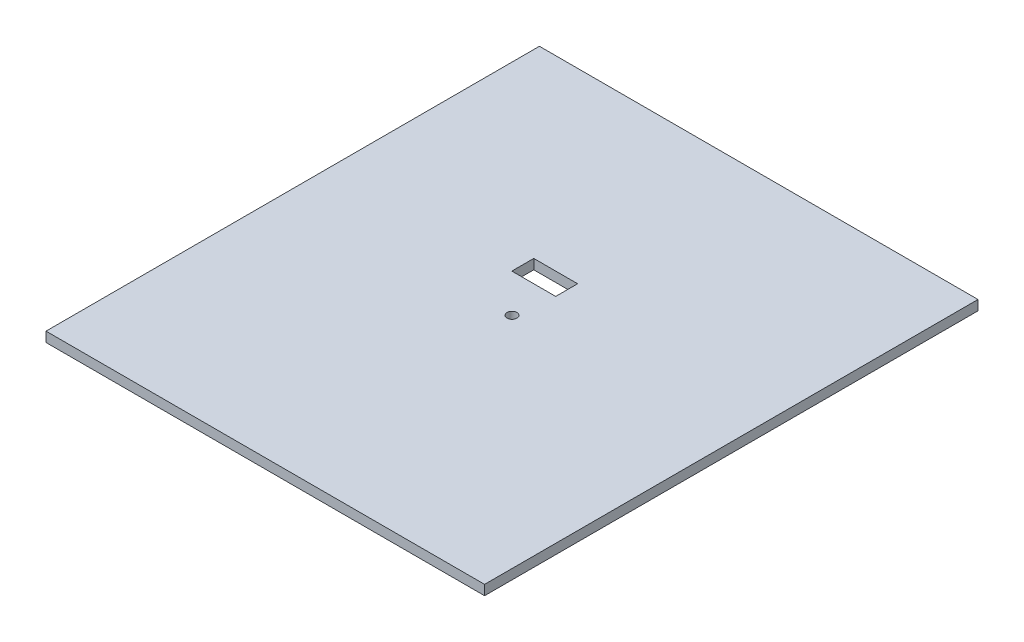
ISO-10303-21;
HEADER;
FILE_DESCRIPTION(('STEP AP214'),'2;1');
FILE_NAME('part.step','',(''),(''),'','','');
FILE_SCHEMA(('AUTOMOTIVE_DESIGN { 1 0 10303 214 1 1 1 1 }'));
ENDSEC;
DATA;
#1=APPLICATION_CONTEXT('core data for automotive mechanical design processes');
#2=APPLICATION_PROTOCOL_DEFINITION('international standard','automotive_design',2000,#1);
#3=PRODUCT_CONTEXT('',#1,'mechanical');
#4=PRODUCT('Part','Part','',(#3));
#5=PRODUCT_RELATED_PRODUCT_CATEGORY('part','',(#4));
#6=PRODUCT_DEFINITION_FORMATION('','',#4);
#7=PRODUCT_DEFINITION_CONTEXT('part definition',#1,'design');
#8=PRODUCT_DEFINITION('design','',#6,#7);
#9=PRODUCT_DEFINITION_SHAPE('','',#8);
#10=(LENGTH_UNIT() NAMED_UNIT(*) SI_UNIT(.MILLI.,.METRE.));
#11=(NAMED_UNIT(*) PLANE_ANGLE_UNIT() SI_UNIT($,.RADIAN.));
#12=(NAMED_UNIT(*) SI_UNIT($,.STERADIAN.) SOLID_ANGLE_UNIT());
#13=UNCERTAINTY_MEASURE_WITH_UNIT(LENGTH_MEASURE(1.E-05),#10,'distance_accuracy_value','');
#14=(GEOMETRIC_REPRESENTATION_CONTEXT(3) GLOBAL_UNCERTAINTY_ASSIGNED_CONTEXT((#13)) GLOBAL_UNIT_ASSIGNED_CONTEXT((#10,
#11,#12)) REPRESENTATION_CONTEXT('',''));
#15=CARTESIAN_POINT('',(0.,0.,0.));
#16=DIRECTION('',(0.,0.,1.));
#17=DIRECTION('',(1.,0.,0.));
#18=AXIS2_PLACEMENT_3D('',#15,#16,#17);
#19=CARTESIAN_POINT('',(-216.666666666667,9.,296.794871794872));
#20=DIRECTION('',(1.,0.,0.));
#21=DIRECTION('',(0.,0.,-1.));
#22=AXIS2_PLACEMENT_3D('',#19,#20,#21);
#23=PLANE('',#22);
#24=DIRECTION('',(0.,0.,1.));
#25=VECTOR('',#24,1.);
#26=CARTESIAN_POINT('',(-216.666666666667,0.,296.794871794872));
#27=LINE('',#26,#25);
#28=CARTESIAN_POINT('',(-216.666666666667,0.,-153.205128205128));
#29=VERTEX_POINT('',#28);
#30=CARTESIAN_POINT('',(-216.666666666667,0.,296.794871794872));
#31=VERTEX_POINT('',#30);
#32=EDGE_CURVE('E139',#29,#31,#27,.T.);
#33=ORIENTED_EDGE('',*,*,#32,.T.);
#34=DIRECTION('',(0.,-1.,0.));
#35=VECTOR('',#34,1.);
#36=CARTESIAN_POINT('',(-216.666666666667,9.,296.794871794872));
#37=LINE('',#36,#35);
#38=CARTESIAN_POINT('',(-216.666666666667,9.,296.794871794872));
#39=VERTEX_POINT('',#38);
#40=EDGE_CURVE('E11',#39,#31,#37,.T.);
#41=ORIENTED_EDGE('',*,*,#40,.F.);
#42=DIRECTION('',(0.,0.,1.));
#43=VECTOR('',#42,1.);
#44=CARTESIAN_POINT('',(-216.666666666667,9.,296.794871794872));
#45=LINE('',#44,#43);
#46=CARTESIAN_POINT('',(-216.666666666667,9.,-153.205128205128));
#47=VERTEX_POINT('',#46);
#48=EDGE_CURVE('E142',#47,#39,#45,.T.);
#49=ORIENTED_EDGE('',*,*,#48,.F.);
#50=DIRECTION('',(0.,-1.,0.));
#51=VECTOR('',#50,1.);
#52=CARTESIAN_POINT('',(-216.666666666667,9.,-153.205128205128));
#53=LINE('',#52,#51);
#54=EDGE_CURVE('E152',#47,#29,#53,.T.);
#55=ORIENTED_EDGE('',*,*,#54,.T.);
#56=EDGE_LOOP('',(#33,#41,#49,#55));
#57=FACE_BOUND('',#56,.T.);
#58=ADVANCED_FACE('F35',(#57),#23,.F.);
#59=CARTESIAN_POINT('',(183.333333333333,9.,296.794871794872));
#60=DIRECTION('',(0.,0.,-1.));
#61=DIRECTION('',(-1.,0.,0.));
#62=AXIS2_PLACEMENT_3D('',#59,#60,#61);
#63=PLANE('',#62);
#64=DIRECTION('',(1.,0.,0.));
#65=VECTOR('',#64,1.);
#66=CARTESIAN_POINT('',(183.333333333333,0.,296.794871794872));
#67=LINE('',#66,#65);
#68=CARTESIAN_POINT('',(183.333333333333,0.,296.794871794872));
#69=VERTEX_POINT('',#68);
#70=EDGE_CURVE('E155',#31,#69,#67,.T.);
#71=ORIENTED_EDGE('',*,*,#70,.T.);
#72=DIRECTION('',(0.,-1.,0.));
#73=VECTOR('',#72,1.);
#74=CARTESIAN_POINT('',(183.333333333333,9.,296.794871794872));
#75=LINE('',#74,#73);
#76=CARTESIAN_POINT('',(183.333333333333,9.,296.794871794872));
#77=VERTEX_POINT('',#76);
#78=EDGE_CURVE('E42',#77,#69,#75,.T.);
#79=ORIENTED_EDGE('',*,*,#78,.F.);
#80=DIRECTION('',(1.,0.,0.));
#81=VECTOR('',#80,1.);
#82=CARTESIAN_POINT('',(183.333333333333,9.,296.794871794872));
#83=LINE('',#82,#81);
#84=EDGE_CURVE('E145',#39,#77,#83,.T.);
#85=ORIENTED_EDGE('',*,*,#84,.F.);
#86=ORIENTED_EDGE('',*,*,#40,.T.);
#87=EDGE_LOOP('',(#71,#79,#85,#86));
#88=FACE_BOUND('',#87,.T.);
#89=ADVANCED_FACE('F184',(#88),#63,.F.);
#90=CARTESIAN_POINT('',(183.333333333333,9.,-153.205128205128));
#91=DIRECTION('',(-1.,0.,0.));
#92=DIRECTION('',(0.,0.,1.));
#93=AXIS2_PLACEMENT_3D('',#90,#91,#92);
#94=PLANE('',#93);
#95=DIRECTION('',(0.,0.,-1.));
#96=VECTOR('',#95,1.);
#97=CARTESIAN_POINT('',(183.333333333333,0.,-153.205128205128));
#98=LINE('',#97,#96);
#99=CARTESIAN_POINT('',(183.333333333333,0.,-153.205128205128));
#100=VERTEX_POINT('',#99);
#101=EDGE_CURVE('E157',#69,#100,#98,.T.);
#102=ORIENTED_EDGE('',*,*,#101,.T.);
#103=DIRECTION('',(0.,-1.,0.));
#104=VECTOR('',#103,1.);
#105=CARTESIAN_POINT('',(183.333333333333,9.,-153.205128205128));
#106=LINE('',#105,#104);
#107=CARTESIAN_POINT('',(183.333333333333,9.,-153.205128205128));
#108=VERTEX_POINT('',#107);
#109=EDGE_CURVE('E162',#108,#100,#106,.T.);
#110=ORIENTED_EDGE('',*,*,#109,.F.);
#111=DIRECTION('',(0.,0.,-1.));
#112=VECTOR('',#111,1.);
#113=CARTESIAN_POINT('',(183.333333333333,9.,-153.205128205128));
#114=LINE('',#113,#112);
#115=EDGE_CURVE('E148',#77,#108,#114,.T.);
#116=ORIENTED_EDGE('',*,*,#115,.F.);
#117=ORIENTED_EDGE('',*,*,#78,.T.);
#118=EDGE_LOOP('',(#102,#110,#116,#117));
#119=FACE_BOUND('',#118,.T.);
#120=ADVANCED_FACE('F169',(#119),#94,.F.);
#121=CARTESIAN_POINT('',(-216.666666666667,9.,-153.205128205128));
#122=DIRECTION('',(0.,0.,1.));
#123=DIRECTION('',(1.,0.,0.));
#124=AXIS2_PLACEMENT_3D('',#121,#122,#123);
#125=PLANE('',#124);
#126=DIRECTION('',(-1.,0.,0.));
#127=VECTOR('',#126,1.);
#128=CARTESIAN_POINT('',(-216.666666666667,0.,-153.205128205128));
#129=LINE('',#128,#127);
#130=EDGE_CURVE('E146',#100,#29,#129,.T.);
#131=ORIENTED_EDGE('',*,*,#130,.T.);
#132=ORIENTED_EDGE('',*,*,#54,.F.);
#133=DIRECTION('',(-1.,0.,0.));
#134=VECTOR('',#133,1.);
#135=CARTESIAN_POINT('',(-216.666666666667,9.,-153.205128205128));
#136=LINE('',#135,#134);
#137=EDGE_CURVE('E150',#108,#47,#136,.T.);
#138=ORIENTED_EDGE('',*,*,#137,.F.);
#139=ORIENTED_EDGE('',*,*,#109,.T.);
#140=EDGE_LOOP('',(#131,#132,#138,#139));
#141=FACE_BOUND('',#140,.T.);
#142=ADVANCED_FACE('F178',(#141),#125,.F.);
#143=CARTESIAN_POINT('',(0.,9.,0.));
#144=DIRECTION('',(0.,-1.,0.));
#145=DIRECTION('',(0.,0.,-1.));
#146=AXIS2_PLACEMENT_3D('',#143,#144,#145);
#147=PLANE('',#146);
#148=DIRECTION('',(1.,0.,0.));
#149=VECTOR('',#148,1.);
#150=CARTESIAN_POINT('',(-11.6666666666666,9.,16.9459245239418));
#151=LINE('',#150,#149);
#152=CARTESIAN_POINT('',(-51.6666666666666,9.,16.9459245239418));
#153=VERTEX_POINT('',#152);
#154=CARTESIAN_POINT('',(-11.6666666666666,9.,16.9459245239418));
#155=VERTEX_POINT('',#154);
#156=EDGE_CURVE('E107',#153,#155,#151,.T.);
#157=ORIENTED_EDGE('',*,*,#156,.T.);
#158=DIRECTION('',(0.,0.,1.));
#159=VECTOR('',#158,1.);
#160=CARTESIAN_POINT('',(-11.6666666666666,9.,36.9459245239418));
#161=LINE('',#160,#159);
#162=CARTESIAN_POINT('',(-11.6666666666666,9.,36.9459245239418));
#163=VERTEX_POINT('',#162);
#164=EDGE_CURVE('E101',#155,#163,#161,.T.);
#165=ORIENTED_EDGE('',*,*,#164,.T.);
#166=DIRECTION('',(-1.,0.,0.));
#167=VECTOR('',#166,1.);
#168=CARTESIAN_POINT('',(-11.6666666666666,9.,36.9459245239418));
#169=LINE('',#168,#167);
#170=CARTESIAN_POINT('',(-51.6666666666666,9.,36.9459245239418));
#171=VERTEX_POINT('',#170);
#172=EDGE_CURVE('E110',#163,#171,#169,.T.);
#173=ORIENTED_EDGE('',*,*,#172,.T.);
#174=DIRECTION('',(0.,0.,-1.));
#175=VECTOR('',#174,1.);
#176=CARTESIAN_POINT('',(-51.6666666666666,9.,36.9459245239418));
#177=LINE('',#176,#175);
#178=EDGE_CURVE('E49',#171,#153,#177,.T.);
#179=ORIENTED_EDGE('',*,*,#178,.T.);
#180=EDGE_LOOP('',(#157,#165,#173,#179));
#181=FACE_BOUND('',#180,.T.);
#182=CARTESIAN_POINT('',(-16.6666666666665,9.,71.7948717948718));
#183=DIRECTION('',(0.,1.,0.));
#184=DIRECTION('',(0.,0.,1.));
#185=AXIS2_PLACEMENT_3D('',#182,#183,#184);
#186=CIRCLE('',#185,4.5);
#187=CARTESIAN_POINT('',(-16.6666666666665,9.,76.2948717948718));
#188=VERTEX_POINT('',#187);
#189=EDGE_CURVE('E136',#188,#188,#186,.T.);
#190=ORIENTED_EDGE('',*,*,#189,.F.);
#191=EDGE_LOOP('',(#190));
#192=FACE_BOUND('',#191,.T.);
#193=ORIENTED_EDGE('',*,*,#48,.T.);
#194=ORIENTED_EDGE('',*,*,#84,.T.);
#195=ORIENTED_EDGE('',*,*,#115,.T.);
#196=ORIENTED_EDGE('',*,*,#137,.T.);
#197=EDGE_LOOP('',(#193,#194,#195,#196));
#198=FACE_BOUND('',#197,.T.);
#199=ADVANCED_FACE('F114',(#181,#192,#198),#147,.F.);
#200=CARTESIAN_POINT('',(0.,0.,0.));
#201=DIRECTION('',(0.,-1.,0.));
#202=DIRECTION('',(0.,0.,-1.));
#203=AXIS2_PLACEMENT_3D('',#200,#201,#202);
#204=PLANE('',#203);
#205=DIRECTION('',(0.,0.,1.));
#206=VECTOR('',#205,1.);
#207=CARTESIAN_POINT('',(-11.6666666666666,0.,36.9459245239418));
#208=LINE('',#207,#206);
#209=CARTESIAN_POINT('',(-11.6666666666666,0.,16.9459245239418));
#210=VERTEX_POINT('',#209);
#211=CARTESIAN_POINT('',(-11.6666666666666,0.,36.9459245239418));
#212=VERTEX_POINT('',#211);
#213=EDGE_CURVE('E57',#210,#212,#208,.T.);
#214=ORIENTED_EDGE('',*,*,#213,.F.);
#215=DIRECTION('',(1.,0.,0.));
#216=VECTOR('',#215,1.);
#217=CARTESIAN_POINT('',(-11.6666666666666,0.,16.9459245239418));
#218=LINE('',#217,#216);
#219=CARTESIAN_POINT('',(-51.6666666666666,0.,16.9459245239418));
#220=VERTEX_POINT('',#219);
#221=EDGE_CURVE('E117',#220,#210,#218,.T.);
#222=ORIENTED_EDGE('',*,*,#221,.F.);
#223=DIRECTION('',(0.,0.,-1.));
#224=VECTOR('',#223,1.);
#225=CARTESIAN_POINT('',(-51.6666666666666,0.,36.9459245239418));
#226=LINE('',#225,#224);
#227=CARTESIAN_POINT('',(-51.6666666666666,0.,36.9459245239418));
#228=VERTEX_POINT('',#227);
#229=EDGE_CURVE('E120',#228,#220,#226,.T.);
#230=ORIENTED_EDGE('',*,*,#229,.F.);
#231=DIRECTION('',(-1.,0.,0.));
#232=VECTOR('',#231,1.);
#233=CARTESIAN_POINT('',(-11.6666666666666,0.,36.9459245239418));
#234=LINE('',#233,#232);
#235=EDGE_CURVE('E126',#212,#228,#234,.T.);
#236=ORIENTED_EDGE('',*,*,#235,.F.);
#237=EDGE_LOOP('',(#214,#222,#230,#236));
#238=FACE_BOUND('',#237,.T.);
#239=CARTESIAN_POINT('',(-16.6666666666665,0.,71.7948717948718));
#240=DIRECTION('',(0.,1.,0.));
#241=DIRECTION('',(0.,0.,1.));
#242=AXIS2_PLACEMENT_3D('',#239,#240,#241);
#243=CIRCLE('',#242,4.5);
#244=CARTESIAN_POINT('',(-16.6666666666665,0.,76.2948717948718));
#245=VERTEX_POINT('',#244);
#246=EDGE_CURVE('E132',#245,#245,#243,.T.);
#247=ORIENTED_EDGE('',*,*,#246,.T.);
#248=EDGE_LOOP('',(#247));
#249=FACE_BOUND('',#248,.T.);
#250=ORIENTED_EDGE('',*,*,#32,.F.);
#251=ORIENTED_EDGE('',*,*,#130,.F.);
#252=ORIENTED_EDGE('',*,*,#101,.F.);
#253=ORIENTED_EDGE('',*,*,#70,.F.);
#254=EDGE_LOOP('',(#250,#251,#252,#253));
#255=FACE_BOUND('',#254,.T.);
#256=ADVANCED_FACE('F175',(#238,#249,#255),#204,.T.);
#257=CARTESIAN_POINT('',(-16.6666666666665,9.,71.7948717948718));
#258=DIRECTION('',(0.,-1.,0.));
#259=DIRECTION('',(0.,0.,-1.));
#260=AXIS2_PLACEMENT_3D('',#257,#258,#259);
#261=CYLINDRICAL_SURFACE('',#260,4.5);
#262=ORIENTED_EDGE('',*,*,#189,.T.);
#263=EDGE_LOOP('',(#262));
#264=FACE_BOUND('',#263,.T.);
#265=ORIENTED_EDGE('',*,*,#246,.F.);
#266=EDGE_LOOP('',(#265));
#267=FACE_BOUND('',#266,.T.);
#268=ADVANCED_FACE('F196',(#264,#267),#261,.F.);
#269=CARTESIAN_POINT('',(-11.6666666666666,9.,36.9459245239418));
#270=DIRECTION('',(1.,0.,0.));
#271=DIRECTION('',(0.,0.,-1.));
#272=AXIS2_PLACEMENT_3D('',#269,#270,#271);
#273=PLANE('',#272);
#274=ORIENTED_EDGE('',*,*,#213,.T.);
#275=DIRECTION('',(0.,-1.,0.));
#276=VECTOR('',#275,1.);
#277=CARTESIAN_POINT('',(-11.6666666666666,9.,36.9459245239418));
#278=LINE('',#277,#276);
#279=EDGE_CURVE('E97',#163,#212,#278,.T.);
#280=ORIENTED_EDGE('',*,*,#279,.F.);
#281=ORIENTED_EDGE('',*,*,#164,.F.);
#282=DIRECTION('',(0.,-1.,0.));
#283=VECTOR('',#282,1.);
#284=CARTESIAN_POINT('',(-11.6666666666666,9.,16.9459245239418));
#285=LINE('',#284,#283);
#286=EDGE_CURVE('E130',#155,#210,#285,.T.);
#287=ORIENTED_EDGE('',*,*,#286,.T.);
#288=EDGE_LOOP('',(#274,#280,#281,#287));
#289=FACE_BOUND('',#288,.T.);
#290=ADVANCED_FACE('F99',(#289),#273,.F.);
#291=CARTESIAN_POINT('',(-11.6666666666666,9.,16.9459245239418));
#292=DIRECTION('',(0.,0.,-1.));
#293=DIRECTION('',(-1.,0.,0.));
#294=AXIS2_PLACEMENT_3D('',#291,#292,#293);
#295=PLANE('',#294);
#296=ORIENTED_EDGE('',*,*,#221,.T.);
#297=ORIENTED_EDGE('',*,*,#286,.F.);
#298=ORIENTED_EDGE('',*,*,#156,.F.);
#299=DIRECTION('',(0.,-1.,0.));
#300=VECTOR('',#299,1.);
#301=CARTESIAN_POINT('',(-51.6666666666666,9.,16.9459245239418));
#302=LINE('',#301,#300);
#303=EDGE_CURVE('E133',#153,#220,#302,.T.);
#304=ORIENTED_EDGE('',*,*,#303,.T.);
#305=EDGE_LOOP('',(#296,#297,#298,#304));
#306=FACE_BOUND('',#305,.T.);
#307=ADVANCED_FACE('F205',(#306),#295,.F.);
#308=CARTESIAN_POINT('',(-51.6666666666666,9.,36.9459245239418));
#309=DIRECTION('',(-1.,0.,0.));
#310=DIRECTION('',(0.,0.,1.));
#311=AXIS2_PLACEMENT_3D('',#308,#309,#310);
#312=PLANE('',#311);
#313=ORIENTED_EDGE('',*,*,#229,.T.);
#314=ORIENTED_EDGE('',*,*,#303,.F.);
#315=ORIENTED_EDGE('',*,*,#178,.F.);
#316=DIRECTION('',(0.,-1.,0.));
#317=VECTOR('',#316,1.);
#318=CARTESIAN_POINT('',(-51.6666666666666,9.,36.9459245239418));
#319=LINE('',#318,#317);
#320=EDGE_CURVE('E106',#171,#228,#319,.T.);
#321=ORIENTED_EDGE('',*,*,#320,.T.);
#322=EDGE_LOOP('',(#313,#314,#315,#321));
#323=FACE_BOUND('',#322,.T.);
#324=ADVANCED_FACE('F208',(#323),#312,.F.);
#325=CARTESIAN_POINT('',(-11.6666666666666,9.,36.9459245239418));
#326=DIRECTION('',(0.,0.,1.));
#327=DIRECTION('',(1.,0.,0.));
#328=AXIS2_PLACEMENT_3D('',#325,#326,#327);
#329=PLANE('',#328);
#330=ORIENTED_EDGE('',*,*,#235,.T.);
#331=ORIENTED_EDGE('',*,*,#320,.F.);
#332=ORIENTED_EDGE('',*,*,#172,.F.);
#333=ORIENTED_EDGE('',*,*,#279,.T.);
#334=EDGE_LOOP('',(#330,#331,#332,#333));
#335=FACE_BOUND('',#334,.T.);
#336=ADVANCED_FACE('F111',(#335),#329,.F.);
#337=CLOSED_SHELL('',(#58,#89,#120,#142,#199,#256,#268,#290,#307,#324,#336));
#338=MANIFOLD_SOLID_BREP('B2',#337);
#339=ADVANCED_BREP_SHAPE_REPRESENTATION('',(#18,#338),#14);
#340=SHAPE_DEFINITION_REPRESENTATION(#9,#339);
ENDSEC;
END-ISO-10303-21;
